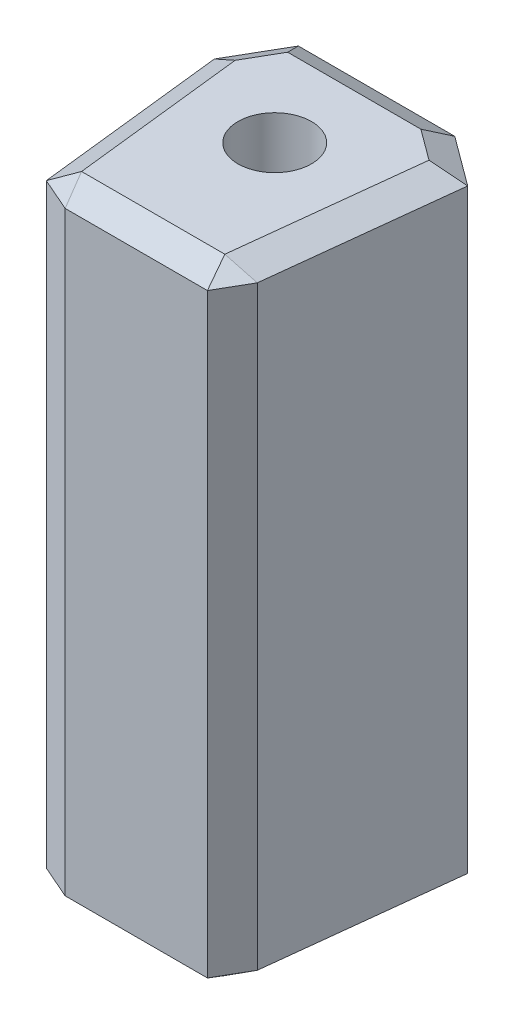
ISO-10303-21;
HEADER;
FILE_DESCRIPTION(('STEP AP214'),'2;1');
FILE_NAME('part.step','',(''),(''),'','','');
FILE_SCHEMA(('AUTOMOTIVE_DESIGN { 1 0 10303 214 1 1 1 1 }'));
ENDSEC;
DATA;
#1=APPLICATION_CONTEXT('core data for automotive mechanical design processes');
#2=APPLICATION_PROTOCOL_DEFINITION('international standard','automotive_design',2000,#1);
#3=PRODUCT_CONTEXT('',#1,'mechanical');
#4=PRODUCT('Part','Part','',(#3));
#5=PRODUCT_RELATED_PRODUCT_CATEGORY('part','',(#4));
#6=PRODUCT_DEFINITION_FORMATION('','',#4);
#7=PRODUCT_DEFINITION_CONTEXT('part definition',#1,'design');
#8=PRODUCT_DEFINITION('design','',#6,#7);
#9=PRODUCT_DEFINITION_SHAPE('','',#8);
#10=(LENGTH_UNIT() NAMED_UNIT(*) SI_UNIT(.MILLI.,.METRE.));
#11=(NAMED_UNIT(*) PLANE_ANGLE_UNIT() SI_UNIT($,.RADIAN.));
#12=(NAMED_UNIT(*) SI_UNIT($,.STERADIAN.) SOLID_ANGLE_UNIT());
#13=UNCERTAINTY_MEASURE_WITH_UNIT(LENGTH_MEASURE(1.E-05),#10,'distance_accuracy_value','');
#14=(GEOMETRIC_REPRESENTATION_CONTEXT(3) GLOBAL_UNCERTAINTY_ASSIGNED_CONTEXT((#13)) GLOBAL_UNIT_ASSIGNED_CONTEXT((#10,
#11,#12)) REPRESENTATION_CONTEXT('',''));
#15=CARTESIAN_POINT('',(0.,0.,0.));
#16=DIRECTION('',(0.,0.,1.));
#17=DIRECTION('',(1.,0.,0.));
#18=AXIS2_PLACEMENT_3D('',#15,#16,#17);
#19=CARTESIAN_POINT('',(0.,-26.9875,61.351983319822));
#20=DIRECTION('',(0.,1.,0.));
#21=DIRECTION('',(0.,0.,1.));
#22=AXIS2_PLACEMENT_3D('',#19,#20,#21);
#23=CYLINDRICAL_SURFACE('',#22,3.175);
#24=CARTESIAN_POINT('',(0.,-26.9875,61.351983319822));
#25=DIRECTION('',(0.,1.,0.));
#26=DIRECTION('',(0.,0.,1.));
#27=AXIS2_PLACEMENT_3D('',#24,#25,#26);
#28=CIRCLE('',#27,3.175);
#29=CARTESIAN_POINT('',(0.,-26.9875,64.526983319822));
#30=VERTEX_POINT('',#29);
#31=EDGE_CURVE('E275',#30,#30,#28,.F.);
#32=ORIENTED_EDGE('',*,*,#31,.T.);
#33=EDGE_LOOP('',(#32));
#34=FACE_BOUND('',#33,.T.);
#35=CARTESIAN_POINT('',(0.,26.9875,61.351983319822));
#36=DIRECTION('',(0.,1.,0.));
#37=DIRECTION('',(0.,0.,1.));
#38=AXIS2_PLACEMENT_3D('',#35,#36,#37);
#39=CIRCLE('',#38,3.175);
#40=CARTESIAN_POINT('',(0.,26.9875,64.526983319822));
#41=VERTEX_POINT('',#40);
#42=EDGE_CURVE('E269',#41,#41,#39,.T.);
#43=ORIENTED_EDGE('',*,*,#42,.T.);
#44=EDGE_LOOP('',(#43));
#45=FACE_BOUND('',#44,.T.);
#46=ADVANCED_FACE('F33',(#34,#45),#23,.F.);
#47=CARTESIAN_POINT('',(0.,26.9875,61.351983319822));
#48=DIRECTION('',(0.,-1.,0.));
#49=DIRECTION('',(0.,0.,-1.));
#50=AXIS2_PLACEMENT_3D('',#47,#48,#49);
#51=PLANE('',#50);
#52=DIRECTION('',(1.,0.,0.));
#53=VECTOR('',#52,1.);
#54=CARTESIAN_POINT('',(8.15555179377801,26.9875,71.8522787942095));
#55=LINE('',#54,#53);
#56=CARTESIAN_POINT('',(-6.18956946928993,26.9875,71.8522787942095));
#57=VERTEX_POINT('',#56);
#58=CARTESIAN_POINT('',(6.18956946928993,26.9875,71.8522787942095));
#59=VERTEX_POINT('',#58);
#60=EDGE_CURVE('E139',#57,#59,#55,.T.);
#61=ORIENTED_EDGE('',*,*,#60,.T.);
#62=DIRECTION('',(0.11186091246358,0.,-0.993723873247904));
#63=VECTOR('',#62,1.);
#64=CARTESIAN_POINT('',(8.11630495456736,26.9875,54.7359956619988));
#65=LINE('',#64,#63);
#66=CARTESIAN_POINT('',(7.97424159573861,26.9875,55.9980249810236));
#67=VERTEX_POINT('',#66);
#68=EDGE_CURVE('E183',#59,#67,#65,.T.);
#69=ORIENTED_EDGE('',*,*,#68,.T.);
#70=DIRECTION('',(-0.804659662347962,0.,-0.59373632850792));
#71=VECTOR('',#70,1.);
#72=CARTESIAN_POINT('',(4.72025423462154,26.9875,53.5969968206666));
#73=LINE('',#72,#71);
#74=CARTESIAN_POINT('',(5.30259191264867,26.9875,54.0266878454345));
#75=VERTEX_POINT('',#74);
#76=EDGE_CURVE('E181',#67,#75,#73,.T.);
#77=ORIENTED_EDGE('',*,*,#76,.T.);
#78=DIRECTION('',(-1.,0.,0.));
#79=VECTOR('',#78,1.);
#80=CARTESIAN_POINT('',(-7.48236225283182,26.9875,54.0266878454345));
#81=LINE('',#80,#79);
#82=CARTESIAN_POINT('',(-6.21236225283181,26.9875,54.0266878454345));
#83=VERTEX_POINT('',#82);
#84=EDGE_CURVE('E179',#75,#83,#81,.T.);
#85=ORIENTED_EDGE('',*,*,#84,.T.);
#86=DIRECTION('',(-0.500000000000002,0.,0.866025403784438));
#87=VECTOR('',#86,1.);
#88=CARTESIAN_POINT('',(-8.23432726075957,26.9875,57.5288339702918));
#89=LINE('',#88,#87);
#90=CARTESIAN_POINT('',(-7.87247385535343,26.9875,56.9020854872365));
#91=VERTEX_POINT('',#90);
#92=EDGE_CURVE('E142',#83,#91,#89,.T.);
#93=ORIENTED_EDGE('',*,*,#92,.T.);
#94=DIRECTION('',(0.11186091246358,0.,0.993723873247904));
#95=VECTOR('',#94,1.);
#96=CARTESIAN_POINT('',(-5.96965289258542,26.9875,73.8059223644367));
#97=LINE('',#96,#95);
#98=EDGE_CURVE('E133',#91,#57,#97,.T.);
#99=ORIENTED_EDGE('',*,*,#98,.T.);
#100=EDGE_LOOP('',(#61,#69,#77,#85,#93,#99));
#101=FACE_BOUND('',#100,.T.);
#102=ORIENTED_EDGE('',*,*,#42,.F.);
#103=EDGE_LOOP('',(#102));
#104=FACE_BOUND('',#103,.T.);
#105=ADVANCED_FACE('F135',(#101,#104),#51,.F.);
#106=CARTESIAN_POINT('',(0.,-26.9875,61.351983319822));
#107=DIRECTION('',(0.,1.,0.));
#108=DIRECTION('',(0.,0.,1.));
#109=AXIS2_PLACEMENT_3D('',#106,#107,#108);
#110=PLANE('',#109);
#111=DIRECTION('',(-0.11186091246358,0.,0.993723873247904));
#112=VECTOR('',#111,1.);
#113=CARTESIAN_POINT('',(5.96965289258544,-26.9875,73.8059223644367));
#114=LINE('',#113,#112);
#115=CARTESIAN_POINT('',(7.97424159573864,-26.9875,55.9980249810236));
#116=VERTEX_POINT('',#115);
#117=CARTESIAN_POINT('',(6.18956946928995,-26.9875,71.8522787942095));
#118=VERTEX_POINT('',#117);
#119=EDGE_CURVE('E42',#116,#118,#114,.T.);
#120=ORIENTED_EDGE('',*,*,#119,.T.);
#121=DIRECTION('',(-1.,0.,0.));
#122=VECTOR('',#121,1.);
#123=CARTESIAN_POINT('',(-8.15555179377802,-26.9875,71.8522787942095));
#124=LINE('',#123,#122);
#125=CARTESIAN_POINT('',(-6.18956946928995,-26.9875,71.8522787942095));
#126=VERTEX_POINT('',#125);
#127=EDGE_CURVE('E11',#118,#126,#124,.T.);
#128=ORIENTED_EDGE('',*,*,#127,.T.);
#129=DIRECTION('',(-0.11186091246358,0.,-0.993723873247904));
#130=VECTOR('',#129,1.);
#131=CARTESIAN_POINT('',(-7.95342835956702,-26.9875,56.1829207521002));
#132=LINE('',#131,#130);
#133=CARTESIAN_POINT('',(-7.87247385535345,-26.9875,56.9020854872365));
#134=VERTEX_POINT('',#133);
#135=EDGE_CURVE('E218',#126,#134,#132,.T.);
#136=ORIENTED_EDGE('',*,*,#135,.T.);
#137=DIRECTION('',(0.500000000000002,0.,-0.866025403784438));
#138=VECTOR('',#137,1.);
#139=CARTESIAN_POINT('',(-5.57736225283182,-26.9875,52.9268355826282));
#140=LINE('',#139,#138);
#141=CARTESIAN_POINT('',(-6.21236225283182,-26.9875,54.0266878454345));
#142=VERTEX_POINT('',#141);
#143=EDGE_CURVE('E220',#134,#142,#140,.T.);
#144=ORIENTED_EDGE('',*,*,#143,.T.);
#145=DIRECTION('',(1.,0.,0.));
#146=VECTOR('',#145,1.);
#147=CARTESIAN_POINT('',(6.02629872346095,-26.9875,54.0266878454345));
#148=LINE('',#147,#146);
#149=CARTESIAN_POINT('',(5.30259191264868,-26.9875,54.0266878454345));
#150=VERTEX_POINT('',#149);
#151=EDGE_CURVE('E222',#142,#150,#148,.T.);
#152=ORIENTED_EDGE('',*,*,#151,.T.);
#153=DIRECTION('',(0.804659662347962,0.,0.59373632850792));
#154=VECTOR('',#153,1.);
#155=CARTESIAN_POINT('',(8.99615936692055,-26.9875,56.7520701182287));
#156=LINE('',#155,#154);
#157=EDGE_CURVE('E53',#150,#116,#156,.T.);
#158=ORIENTED_EDGE('',*,*,#157,.T.);
#159=EDGE_LOOP('',(#120,#128,#136,#144,#152,#158));
#160=FACE_BOUND('',#159,.T.);
#161=ORIENTED_EDGE('',*,*,#31,.F.);
#162=EDGE_LOOP('',(#161));
#163=FACE_BOUND('',#162,.T.);
#164=ADVANCED_FACE('F337',(#160,#163),#110,.F.);
#165=CARTESIAN_POINT('',(-8.15555179377802,57.7814621639103,74.051983319822));
#166=DIRECTION('',(-0.993723873247903,0.,0.11186091246358));
#167=DIRECTION('',(0.11186091246358,0.,0.993723873247903));
#168=AXIS2_PLACEMENT_3D('',#165,#166,#167);
#169=PLANE('',#168);
#170=DIRECTION('',(0.,1.,0.));
#171=VECTOR('',#170,1.);
#172=CARTESIAN_POINT('',(-8.29761515260676,57.7814621639103,72.7899540007972));
#173=LINE('',#172,#171);
#174=CARTESIAN_POINT('',(-8.29761515260676,-25.7175,72.7899540007972));
#175=VERTEX_POINT('',#174);
#176=CARTESIAN_POINT('',(-8.29761515260676,25.7175,72.7899540007972));
#177=VERTEX_POINT('',#176);
#178=EDGE_CURVE('E206',#175,#177,#173,.T.);
#179=ORIENTED_EDGE('',*,*,#178,.T.);
#180=DIRECTION('',(-0.11186091246358,0.,-0.993723873247903));
#181=VECTOR('',#180,1.);
#182=CARTESIAN_POINT('',(-10.1393272607596,25.7175,56.4289817074855));
#183=LINE('',#182,#181);
#184=CARTESIAN_POINT('',(-10.1393272607596,25.7175,56.4289817074855));
#185=VERTEX_POINT('',#184);
#186=EDGE_CURVE('E152',#177,#185,#183,.T.);
#187=ORIENTED_EDGE('',*,*,#186,.T.);
#188=DIRECTION('',(0.,-1.,0.));
#189=VECTOR('',#188,1.);
#190=CARTESIAN_POINT('',(-10.1393272607596,57.7814621639103,56.4289817074855));
#191=LINE('',#190,#189);
#192=CARTESIAN_POINT('',(-10.1393272607596,-25.7175,56.4289817074855));
#193=VERTEX_POINT('',#192);
#194=EDGE_CURVE('E280',#185,#193,#191,.T.);
#195=ORIENTED_EDGE('',*,*,#194,.T.);
#196=DIRECTION('',(0.11186091246358,0.,0.993723873247903));
#197=VECTOR('',#196,1.);
#198=CARTESIAN_POINT('',(-8.15555179377802,-25.7175,74.051983319822));
#199=LINE('',#198,#197);
#200=EDGE_CURVE('E204',#193,#175,#199,.T.);
#201=ORIENTED_EDGE('',*,*,#200,.T.);
#202=EDGE_LOOP('',(#179,#187,#195,#201));
#203=FACE_BOUND('',#202,.T.);
#204=ADVANCED_FACE('F358',(#203),#169,.T.);
#205=CARTESIAN_POINT('',(-10.6573622528318,57.7814621639103,51.826983319822));
#206=DIRECTION('',(0.,0.,-1.));
#207=DIRECTION('',(-1.,0.,0.));
#208=AXIS2_PLACEMENT_3D('',#205,#206,#207);
#209=PLANE('',#208);
#210=DIRECTION('',(0.,1.,0.));
#211=VECTOR('',#210,1.);
#212=CARTESIAN_POINT('',(-7.48236225283182,57.7814621639103,51.826983319822));
#213=LINE('',#212,#211);
#214=CARTESIAN_POINT('',(-7.48236225283182,-25.7175,51.826983319822));
#215=VERTEX_POINT('',#214);
#216=CARTESIAN_POINT('',(-7.48236225283182,25.7175,51.826983319822));
#217=VERTEX_POINT('',#216);
#218=EDGE_CURVE('E174',#215,#217,#213,.T.);
#219=ORIENTED_EDGE('',*,*,#218,.T.);
#220=DIRECTION('',(1.,0.,0.));
#221=VECTOR('',#220,1.);
#222=CARTESIAN_POINT('',(6.02629872346095,25.7175,51.826983319822));
#223=LINE('',#222,#221);
#224=CARTESIAN_POINT('',(6.02629872346095,25.7175,51.826983319822));
#225=VERTEX_POINT('',#224);
#226=EDGE_CURVE('E198',#217,#225,#223,.T.);
#227=ORIENTED_EDGE('',*,*,#226,.T.);
#228=DIRECTION('',(0.,-1.,0.));
#229=VECTOR('',#228,1.);
#230=CARTESIAN_POINT('',(6.02629872346095,57.7814621639103,51.826983319822));
#231=LINE('',#230,#229);
#232=CARTESIAN_POINT('',(6.02629872346095,-25.7175,51.826983319822));
#233=VERTEX_POINT('',#232);
#234=EDGE_CURVE('E285',#225,#233,#231,.T.);
#235=ORIENTED_EDGE('',*,*,#234,.T.);
#236=DIRECTION('',(-1.,0.,0.));
#237=VECTOR('',#236,1.);
#238=CARTESIAN_POINT('',(-7.48236225283182,-25.7175,51.826983319822));
#239=LINE('',#238,#237);
#240=EDGE_CURVE('E196',#233,#215,#239,.T.);
#241=ORIENTED_EDGE('',*,*,#240,.T.);
#242=EDGE_LOOP('',(#219,#227,#235,#241));
#243=FACE_BOUND('',#242,.T.);
#244=ADVANCED_FACE('F291',(#243),#209,.T.);
#245=CARTESIAN_POINT('',(8.15555179377801,57.7814621639103,74.051983319822));
#246=DIRECTION('',(0.993723873247903,0.,0.11186091246358));
#247=DIRECTION('',(0.11186091246358,0.,-0.993723873247903));
#248=AXIS2_PLACEMENT_3D('',#245,#246,#247);
#249=PLANE('',#248);
#250=DIRECTION('',(0.,1.,0.));
#251=VECTOR('',#250,1.);
#252=CARTESIAN_POINT('',(10.30220385576,57.7814621639103,54.9820566173841));
#253=LINE('',#252,#251);
#254=CARTESIAN_POINT('',(10.30220385576,-25.7175,54.9820566173841));
#255=VERTEX_POINT('',#254);
#256=CARTESIAN_POINT('',(10.30220385576,25.7175,54.9820566173841));
#257=VERTEX_POINT('',#256);
#258=EDGE_CURVE('E171',#255,#257,#253,.T.);
#259=ORIENTED_EDGE('',*,*,#258,.T.);
#260=DIRECTION('',(-0.11186091246358,0.,0.993723873247903));
#261=VECTOR('',#260,1.);
#262=CARTESIAN_POINT('',(8.15555179377801,25.7175,74.051983319822));
#263=LINE('',#262,#261);
#264=CARTESIAN_POINT('',(8.46313756566153,25.7175,71.319524609622));
#265=VERTEX_POINT('',#264);
#266=EDGE_CURVE('E189',#257,#265,#263,.T.);
#267=ORIENTED_EDGE('',*,*,#266,.T.);
#268=DIRECTION('',(0.,-1.,0.));
#269=VECTOR('',#268,1.);
#270=CARTESIAN_POINT('',(8.46313756566153,57.7814621639103,71.319524609622));
#271=LINE('',#270,#269);
#272=CARTESIAN_POINT('',(8.46313756566153,-25.7175,71.319524609622));
#273=VERTEX_POINT('',#272);
#274=EDGE_CURVE('E187',#265,#273,#271,.T.);
#275=ORIENTED_EDGE('',*,*,#274,.T.);
#276=DIRECTION('',(0.11186091246358,0.,-0.993723873247903));
#277=VECTOR('',#276,1.);
#278=CARTESIAN_POINT('',(10.30220385576,-25.7175,54.9820566173841));
#279=LINE('',#278,#277);
#280=EDGE_CURVE('E185',#273,#255,#279,.T.);
#281=ORIENTED_EDGE('',*,*,#280,.T.);
#282=EDGE_LOOP('',(#259,#267,#275,#281));
#283=FACE_BOUND('',#282,.T.);
#284=ADVANCED_FACE('F314',(#283),#249,.T.);
#285=CARTESIAN_POINT('',(8.15555179377801,57.7814621639103,74.051983319822));
#286=DIRECTION('',(0.,0.,1.));
#287=DIRECTION('',(1.,0.,0.));
#288=AXIS2_PLACEMENT_3D('',#285,#286,#287);
#289=PLANE('',#288);
#290=DIRECTION('',(0.,1.,0.));
#291=VECTOR('',#290,1.);
#292=CARTESIAN_POINT('',(6.88555179377801,57.7814621639103,74.051983319822));
#293=LINE('',#292,#291);
#294=CARTESIAN_POINT('',(6.88555179377801,-25.7175,74.051983319822));
#295=VERTEX_POINT('',#294);
#296=CARTESIAN_POINT('',(6.88555179377801,25.7175,74.051983319822));
#297=VERTEX_POINT('',#296);
#298=EDGE_CURVE('E213',#295,#297,#293,.T.);
#299=ORIENTED_EDGE('',*,*,#298,.T.);
#300=DIRECTION('',(-1.,0.,0.));
#301=VECTOR('',#300,1.);
#302=CARTESIAN_POINT('',(-8.15555179377802,25.7175,74.051983319822));
#303=LINE('',#302,#301);
#304=CARTESIAN_POINT('',(-5.40583551568441,25.7175,74.051983319822));
#305=VERTEX_POINT('',#304);
#306=EDGE_CURVE('E215',#297,#305,#303,.T.);
#307=ORIENTED_EDGE('',*,*,#306,.T.);
#308=DIRECTION('',(0.,-1.,0.));
#309=VECTOR('',#308,1.);
#310=CARTESIAN_POINT('',(-5.40583551568441,57.7814621639103,74.051983319822));
#311=LINE('',#310,#309);
#312=CARTESIAN_POINT('',(-5.40583551568441,-25.7175,74.051983319822));
#313=VERTEX_POINT('',#312);
#314=EDGE_CURVE('E211',#305,#313,#311,.T.);
#315=ORIENTED_EDGE('',*,*,#314,.T.);
#316=DIRECTION('',(1.,0.,0.));
#317=VECTOR('',#316,1.);
#318=CARTESIAN_POINT('',(8.15555179377801,-25.7175,74.051983319822));
#319=LINE('',#318,#317);
#320=EDGE_CURVE('E209',#313,#295,#319,.T.);
#321=ORIENTED_EDGE('',*,*,#320,.T.);
#322=EDGE_LOOP('',(#299,#307,#315,#321));
#323=FACE_BOUND('',#322,.T.);
#324=ADVANCED_FACE('F376',(#323),#289,.T.);
#325=CARTESIAN_POINT('',(-10.1393272607596,57.7814621639103,56.4289817074855));
#326=DIRECTION('',(0.866025403784438,0.,0.500000000000002));
#327=DIRECTION('',(0.,-1.,0.));
#328=AXIS2_PLACEMENT_3D('',#325,#326,#327);
#329=PLANE('',#328);
#330=ORIENTED_EDGE('',*,*,#194,.F.);
#331=DIRECTION('',(-0.500000000000002,0.,0.866025403784438));
#332=VECTOR('',#331,1.);
#333=CARTESIAN_POINT('',(-7.48236225283182,25.7175,51.826983319822));
#334=LINE('',#333,#332);
#335=EDGE_CURVE('E202',#185,#217,#334,.F.);
#336=ORIENTED_EDGE('',*,*,#335,.T.);
#337=ORIENTED_EDGE('',*,*,#218,.F.);
#338=DIRECTION('',(0.500000000000002,0.,-0.866025403784438));
#339=VECTOR('',#338,1.);
#340=CARTESIAN_POINT('',(-10.1393272607596,-25.7175,56.4289817074855));
#341=LINE('',#340,#339);
#342=EDGE_CURVE('E200',#215,#193,#341,.F.);
#343=ORIENTED_EDGE('',*,*,#342,.T.);
#344=EDGE_LOOP('',(#330,#336,#337,#343));
#345=FACE_BOUND('',#344,.T.);
#346=ADVANCED_FACE('F373',(#345),#329,.F.);
#347=CARTESIAN_POINT('',(6.02629872346095,57.7814621639103,51.826983319822));
#348=DIRECTION('',(-0.59373632850792,0.,0.804659662347962));
#349=DIRECTION('',(0.,-1.,0.));
#350=AXIS2_PLACEMENT_3D('',#347,#348,#349);
#351=PLANE('',#350);
#352=ORIENTED_EDGE('',*,*,#234,.F.);
#353=DIRECTION('',(-0.804659662347962,0.,-0.59373632850792));
#354=VECTOR('',#353,1.);
#355=CARTESIAN_POINT('',(10.30220385576,25.7175,54.9820566173841));
#356=LINE('',#355,#354);
#357=EDGE_CURVE('E194',#225,#257,#356,.F.);
#358=ORIENTED_EDGE('',*,*,#357,.T.);
#359=ORIENTED_EDGE('',*,*,#258,.F.);
#360=DIRECTION('',(0.804659662347962,0.,0.59373632850792));
#361=VECTOR('',#360,1.);
#362=CARTESIAN_POINT('',(6.02629872346095,-25.7175,51.826983319822));
#363=LINE('',#362,#361);
#364=EDGE_CURVE('E192',#255,#233,#363,.F.);
#365=ORIENTED_EDGE('',*,*,#364,.T.);
#366=EDGE_LOOP('',(#352,#358,#359,#365));
#367=FACE_BOUND('',#366,.T.);
#368=ADVANCED_FACE('F310',(#367),#351,.F.);
#369=CARTESIAN_POINT('',(-7.83121767514725,-26.9875,56.8306276869932));
#370=DIRECTION('',(0.433012701892217,0.86602540378444,0.25));
#371=DIRECTION('',(0.500000000000002,0.,-0.866025403784438));
#372=AXIS2_PLACEMENT_3D('',#369,#370,#371);
#373=PLANE('',#372);
#374=DIRECTION('',(-0.858302515958377,0.480862235143889,-0.179132079516602));
#375=VECTOR('',#374,1.);
#376=CARTESIAN_POINT('',(-6.62535400302543,-27.6861963553441,57.1623657129149));
#377=LINE('',#376,#375);
#378=EDGE_CURVE('E262',#193,#134,#377,.F.);
#379=ORIENTED_EDGE('',*,*,#378,.F.);
#380=ORIENTED_EDGE('',*,*,#342,.F.);
#381=DIRECTION('',(-0.447213595499958,0.447213595499956,-0.774596669241484));
#382=VECTOR('',#381,1.);
#383=CARTESIAN_POINT('',(-5.56482008390565,-27.6350421689262,55.1482637820579));
#384=LINE('',#383,#382);
#385=EDGE_CURVE('E37',#142,#215,#384,.T.);
#386=ORIENTED_EDGE('',*,*,#385,.F.);
#387=ORIENTED_EDGE('',*,*,#143,.F.);
#388=EDGE_LOOP('',(#379,#380,#386,#387));
#389=FACE_BOUND('',#388,.T.);
#390=ADVANCED_FACE('F35',(#389),#373,.F.);
#391=CARTESIAN_POINT('',(0.,-26.9875,54.0266878454345));
#392=DIRECTION('',(0.,-0.86602540378444,-0.499999999999998));
#393=DIRECTION('',(-1.,0.,0.));
#394=AXIS2_PLACEMENT_3D('',#391,#392,#393);
#395=PLANE('',#394);
#396=ORIENTED_EDGE('',*,*,#385,.T.);
#397=ORIENTED_EDGE('',*,*,#240,.F.);
#398=DIRECTION('',(0.274018326485077,0.48086223514389,-0.832877822710354));
#399=VECTOR('',#398,1.);
#400=CARTESIAN_POINT('',(4.90444126696012,-27.6861963677417,55.2368654534269));
#401=LINE('',#400,#399);
#402=EDGE_CURVE('E260',#150,#233,#401,.T.);
#403=ORIENTED_EDGE('',*,*,#402,.F.);
#404=ORIENTED_EDGE('',*,*,#151,.F.);
#405=EDGE_LOOP('',(#396,#397,#403,#404));
#406=FACE_BOUND('',#405,.T.);
#407=ADVANCED_FACE('F343',(#406),#395,.T.);
#408=CARTESIAN_POINT('',(-7.27932109610744,-26.9875,62.1713975674284));
#409=DIRECTION('',(-0.49686193662395,-0.86602540378444,0.0559304562317897));
#410=DIRECTION('',(0.11186091246358,0.,0.993723873247903));
#411=AXIS2_PLACEMENT_3D('',#408,#409,#410);
#412=PLANE('',#411);
#413=ORIENTED_EDGE('',*,*,#378,.T.);
#414=ORIENTED_EDGE('',*,*,#135,.F.);
#415=DIRECTION('',(0.8004344008291,-0.482224696123996,-0.3560394815431));
#416=VECTOR('',#415,1.);
#417=CARTESIAN_POINT('',(-6.80452673478932,-26.6170166972115,72.1258165953744));
#418=LINE('',#417,#416);
#419=EDGE_CURVE('E257',#175,#126,#418,.T.);
#420=ORIENTED_EDGE('',*,*,#419,.F.);
#421=ORIENTED_EDGE('',*,*,#200,.F.);
#422=EDGE_LOOP('',(#413,#414,#420,#421));
#423=FACE_BOUND('',#422,.T.);
#424=ADVANCED_FACE('F348',(#423),#412,.T.);
#425=CARTESIAN_POINT('',(5.36898616950178,-26.9875,54.0756783492991));
#426=DIRECTION('',(-0.296868164253959,0.866025403784439,0.40232983117398));
#427=DIRECTION('',(0.804659662347962,0.,0.59373632850792));
#428=AXIS2_PLACEMENT_3D('',#425,#426,#427);
#429=PLANE('',#428);
#430=ORIENTED_EDGE('',*,*,#402,.T.);
#431=ORIENTED_EDGE('',*,*,#364,.F.);
#432=DIRECTION('',(0.819760923222317,0.447213595499956,-0.357759736076736));
#433=VECTOR('',#432,1.);
#434=CARTESIAN_POINT('',(6.7872701033101,-27.6350421965691,56.5160426076661));
#435=LINE('',#434,#433);
#436=EDGE_CURVE('E254',#116,#255,#435,.T.);
#437=ORIENTED_EDGE('',*,*,#436,.F.);
#438=ORIENTED_EDGE('',*,*,#157,.F.);
#439=EDGE_LOOP('',(#430,#431,#437,#438));
#440=FACE_BOUND('',#439,.T.);
#441=ADVANCED_FACE('F345',(#440),#429,.F.);
#442=CARTESIAN_POINT('',(-5.40583551568441,-25.7175,74.051983319822));
#443=DIRECTION('',(-0.239154945433982,-0.801566240282257,0.547993133637855));
#444=DIRECTION('',(0.,-0.564370361850618,-0.82552171059555));
#445=AXIS2_PLACEMENT_3D('',#442,#443,#444);
#446=PLANE('',#445);
#447=DIRECTION('',(0.916520574811541,0.,0.399987544739985));
#448=VECTOR('',#447,1.);
#449=CARTESIAN_POINT('',(-5.40583551568441,-25.7175,74.051983319822));
#450=LINE('',#449,#448);
#451=EDGE_CURVE('E249',#175,#313,#450,.T.);
#452=ORIENTED_EDGE('',*,*,#451,.F.);
#453=ORIENTED_EDGE('',*,*,#419,.T.);
#454=DIRECTION('',(0.294840267172246,0.477773276998041,0.827527590259293));
#455=VECTOR('',#454,1.);
#456=CARTESIAN_POINT('',(-5.40583551568441,-25.7175,74.051983319822));
#457=LINE('',#456,#455);
#458=EDGE_CURVE('E252',#313,#126,#457,.F.);
#459=ORIENTED_EDGE('',*,*,#458,.F.);
#460=EDGE_LOOP('',(#452,#453,#459));
#461=FACE_BOUND('',#460,.T.);
#462=ADVANCED_FACE('F347',(#461),#446,.T.);
#463=CARTESIAN_POINT('',(7.27932109610743,-26.9875,62.1713975674284));
#464=DIRECTION('',(0.496861936623949,-0.86602540378444,0.0559304562317897));
#465=DIRECTION('',(0.11186091246358,0.,-0.993723873247903));
#466=AXIS2_PLACEMENT_3D('',#463,#464,#465);
#467=PLANE('',#466);
#468=ORIENTED_EDGE('',*,*,#436,.T.);
#469=ORIENTED_EDGE('',*,*,#280,.F.);
#470=DIRECTION('',(0.855315023528859,0.47777327699804,-0.200421820948673));
#471=VECTOR('',#470,1.);
#472=CARTESIAN_POINT('',(8.46313756566153,-25.7175,71.319524609622));
#473=LINE('',#472,#471);
#474=EDGE_CURVE('E246',#118,#273,#473,.T.);
#475=ORIENTED_EDGE('',*,*,#474,.F.);
#476=ORIENTED_EDGE('',*,*,#119,.F.);
#477=EDGE_LOOP('',(#468,#469,#475,#476));
#478=FACE_BOUND('',#477,.T.);
#479=ADVANCED_FACE('F329',(#478),#467,.T.);
#480=CARTESIAN_POINT('',(0.,-26.9875,71.8522787942095));
#481=DIRECTION('',(0.,-0.86602540378444,0.499999999999997));
#482=DIRECTION('',(1.,0.,0.));
#483=AXIS2_PLACEMENT_3D('',#480,#481,#482);
#484=PLANE('',#483);
#485=ORIENTED_EDGE('',*,*,#458,.T.);
#486=ORIENTED_EDGE('',*,*,#127,.F.);
#487=DIRECTION('',(-0.264267610184196,-0.482224696123996,-0.835237674351231));
#488=VECTOR('',#487,1.);
#489=CARTESIAN_POINT('',(6.39260083169839,-26.6170166972115,72.493974697995));
#490=LINE('',#489,#488);
#491=EDGE_CURVE('E243',#295,#118,#490,.T.);
#492=ORIENTED_EDGE('',*,*,#491,.F.);
#493=ORIENTED_EDGE('',*,*,#320,.F.);
#494=EDGE_LOOP('',(#485,#486,#492,#493));
#495=FACE_BOUND('',#494,.T.);
#496=ADVANCED_FACE('F335',(#495),#484,.T.);
#497=CARTESIAN_POINT('',(-5.40583551568441,57.7814621639103,74.051983319822));
#498=DIRECTION('',(0.399987544739985,0.,-0.916520574811541));
#499=DIRECTION('',(0.,-1.,0.));
#500=AXIS2_PLACEMENT_3D('',#497,#498,#499);
#501=PLANE('',#500);
#502=ORIENTED_EDGE('',*,*,#451,.T.);
#503=ORIENTED_EDGE('',*,*,#314,.F.);
#504=DIRECTION('',(-0.916520574811541,0.,-0.399987544739985));
#505=VECTOR('',#504,1.);
#506=CARTESIAN_POINT('',(-6.87058451764001,25.7175,73.4127381429496));
#507=LINE('',#506,#505);
#508=EDGE_CURVE('E156',#177,#305,#507,.F.);
#509=ORIENTED_EDGE('',*,*,#508,.F.);
#510=ORIENTED_EDGE('',*,*,#178,.F.);
#511=EDGE_LOOP('',(#502,#503,#509,#510));
#512=FACE_BOUND('',#511,.T.);
#513=ADVANCED_FACE('F399',(#512),#501,.F.);
#514=CARTESIAN_POINT('',(-7.27932109610742,26.9875,62.1713975674284));
#515=DIRECTION('',(-0.49686193662395,0.866025403784439,0.0559304562317898));
#516=DIRECTION('',(-0.11186091246358,0.,-0.993723873247903));
#517=AXIS2_PLACEMENT_3D('',#514,#515,#516);
#518=PLANE('',#517);
#519=DIRECTION('',(0.858302515958377,0.48086223514389,0.179132079516603));
#520=VECTOR('',#519,1.);
#521=CARTESIAN_POINT('',(-6.62535400302541,27.6861963553441,57.1623657129149));
#522=LINE('',#521,#520);
#523=EDGE_CURVE('E157',#185,#91,#522,.T.);
#524=ORIENTED_EDGE('',*,*,#523,.F.);
#525=ORIENTED_EDGE('',*,*,#186,.F.);
#526=DIRECTION('',(-0.800434400829099,-0.482224696123997,0.356039481543101));
#527=VECTOR('',#526,1.);
#528=CARTESIAN_POINT('',(-6.18956946928993,26.9875,71.8522787942095));
#529=LINE('',#528,#527);
#530=EDGE_CURVE('E149',#57,#177,#529,.T.);
#531=ORIENTED_EDGE('',*,*,#530,.F.);
#532=ORIENTED_EDGE('',*,*,#98,.F.);
#533=EDGE_LOOP('',(#524,#525,#531,#532));
#534=FACE_BOUND('',#533,.T.);
#535=ADVANCED_FACE('F151',(#534),#518,.T.);
#536=CARTESIAN_POINT('',(8.46313756566153,-25.7175,71.319524609622));
#537=DIRECTION('',(0.517801768855446,-0.801566240282255,0.298952990635555));
#538=DIRECTION('',(0.839980356827693,0.542616807833688,0.));
#539=AXIS2_PLACEMENT_3D('',#536,#537,#538);
#540=PLANE('',#539);
#541=ORIENTED_EDGE('',*,*,#491,.T.);
#542=ORIENTED_EDGE('',*,*,#474,.T.);
#543=DIRECTION('',(0.499999999999999,0.,-0.866025403784439));
#544=VECTOR('',#543,1.);
#545=CARTESIAN_POINT('',(8.46313756566153,-25.7175,71.319524609622));
#546=LINE('',#545,#544);
#547=EDGE_CURVE('E164',#295,#273,#546,.T.);
#548=ORIENTED_EDGE('',*,*,#547,.F.);
#549=EDGE_LOOP('',(#541,#542,#548));
#550=FACE_BOUND('',#549,.T.);
#551=ADVANCED_FACE('F331',(#550),#540,.T.);
#552=CARTESIAN_POINT('',(-6.18956946928993,26.9875,71.8522787942095));
#553=DIRECTION('',(-0.239154945433982,0.801566240282258,0.547993133637854));
#554=DIRECTION('',(0.,-0.564370361850618,0.82552171059555));
#555=AXIS2_PLACEMENT_3D('',#552,#553,#554);
#556=PLANE('',#555);
#557=ORIENTED_EDGE('',*,*,#530,.T.);
#558=ORIENTED_EDGE('',*,*,#508,.T.);
#559=DIRECTION('',(-0.294840267172236,0.477773276998044,-0.827527590259294));
#560=VECTOR('',#559,1.);
#561=CARTESIAN_POINT('',(-6.18956946928993,26.9875,71.8522787942095));
#562=LINE('',#561,#560);
#563=EDGE_CURVE('E159',#57,#305,#562,.F.);
#564=ORIENTED_EDGE('',*,*,#563,.F.);
#565=EDGE_LOOP('',(#557,#558,#564));
#566=FACE_BOUND('',#565,.T.);
#567=ADVANCED_FACE('F160',(#566),#556,.T.);
#568=CARTESIAN_POINT('',(-7.83121767514723,26.9875,56.8306276869932));
#569=DIRECTION('',(0.433012701892217,-0.86602540378444,0.25));
#570=DIRECTION('',(-0.500000000000002,0.,0.866025403784438));
#571=AXIS2_PLACEMENT_3D('',#568,#569,#570);
#572=PLANE('',#571);
#573=ORIENTED_EDGE('',*,*,#523,.T.);
#574=ORIENTED_EDGE('',*,*,#92,.F.);
#575=DIRECTION('',(0.447213595499958,0.447213595499957,0.774596669241484));
#576=VECTOR('',#575,1.);
#577=CARTESIAN_POINT('',(-5.56482008390564,27.6350421689262,55.148263782058));
#578=LINE('',#577,#576);
#579=EDGE_CURVE('E165',#217,#83,#578,.T.);
#580=ORIENTED_EDGE('',*,*,#579,.F.);
#581=ORIENTED_EDGE('',*,*,#335,.F.);
#582=EDGE_LOOP('',(#573,#574,#580,#581));
#583=FACE_BOUND('',#582,.T.);
#584=ADVANCED_FACE('F298',(#583),#572,.F.);
#585=CARTESIAN_POINT('',(8.46313756566153,57.7814621639103,71.319524609622));
#586=DIRECTION('',(-0.866025403784439,0.,-0.499999999999999));
#587=DIRECTION('',(0.,-1.,0.));
#588=AXIS2_PLACEMENT_3D('',#585,#586,#587);
#589=PLANE('',#588);
#590=ORIENTED_EDGE('',*,*,#547,.T.);
#591=ORIENTED_EDGE('',*,*,#274,.F.);
#592=DIRECTION('',(-0.499999999999999,0.,0.866025403784439));
#593=VECTOR('',#592,1.);
#594=CARTESIAN_POINT('',(8.46313756566153,25.7175,71.319524609622));
#595=LINE('',#594,#593);
#596=EDGE_CURVE('E234',#297,#265,#595,.F.);
#597=ORIENTED_EDGE('',*,*,#596,.F.);
#598=ORIENTED_EDGE('',*,*,#298,.F.);
#599=EDGE_LOOP('',(#590,#591,#597,#598));
#600=FACE_BOUND('',#599,.T.);
#601=ADVANCED_FACE('F325',(#600),#589,.F.);
#602=CARTESIAN_POINT('',(0.,26.9875,71.8522787942095));
#603=DIRECTION('',(0.,0.866025403784439,0.499999999999999));
#604=DIRECTION('',(-1.,0.,0.));
#605=AXIS2_PLACEMENT_3D('',#602,#603,#604);
#606=PLANE('',#605);
#607=ORIENTED_EDGE('',*,*,#563,.T.);
#608=ORIENTED_EDGE('',*,*,#306,.F.);
#609=DIRECTION('',(0.2642676101842,-0.482224696123997,0.835237674351229));
#610=VECTOR('',#609,1.);
#611=CARTESIAN_POINT('',(6.39260083169838,26.6170166972115,72.4939746979951));
#612=LINE('',#611,#610);
#613=EDGE_CURVE('E169',#59,#297,#612,.T.);
#614=ORIENTED_EDGE('',*,*,#613,.F.);
#615=ORIENTED_EDGE('',*,*,#60,.F.);
#616=EDGE_LOOP('',(#607,#608,#614,#615));
#617=FACE_BOUND('',#616,.T.);
#618=ADVANCED_FACE('F167',(#617),#606,.T.);
#619=CARTESIAN_POINT('',(0.,26.9875,54.0266878454345));
#620=DIRECTION('',(0.,0.866025403784439,-0.499999999999999));
#621=DIRECTION('',(1.,0.,0.));
#622=AXIS2_PLACEMENT_3D('',#619,#620,#621);
#623=PLANE('',#622);
#624=ORIENTED_EDGE('',*,*,#579,.T.);
#625=ORIENTED_EDGE('',*,*,#84,.F.);
#626=DIRECTION('',(-0.274018326485076,0.480862235143891,0.832877822710354));
#627=VECTOR('',#626,1.);
#628=CARTESIAN_POINT('',(4.90444126696012,27.6861963677417,55.2368654534269));
#629=LINE('',#628,#627);
#630=EDGE_CURVE('E230',#225,#75,#629,.T.);
#631=ORIENTED_EDGE('',*,*,#630,.F.);
#632=ORIENTED_EDGE('',*,*,#226,.F.);
#633=EDGE_LOOP('',(#624,#625,#631,#632));
#634=FACE_BOUND('',#633,.T.);
#635=ADVANCED_FACE('F302',(#634),#623,.T.);
#636=CARTESIAN_POINT('',(8.46313756566153,25.7175,71.319524609622));
#637=DIRECTION('',(0.517801768855445,0.801566240282255,0.298952990635555));
#638=DIRECTION('',(-0.839980356827694,0.542616807833687,0.));
#639=AXIS2_PLACEMENT_3D('',#636,#637,#638);
#640=PLANE('',#639);
#641=ORIENTED_EDGE('',*,*,#613,.T.);
#642=ORIENTED_EDGE('',*,*,#596,.T.);
#643=DIRECTION('',(-0.85531502352886,0.477773276998041,0.200421820948666));
#644=VECTOR('',#643,1.);
#645=CARTESIAN_POINT('',(8.46313756566153,25.7175,71.319524609622));
#646=LINE('',#645,#644);
#647=EDGE_CURVE('E228',#59,#265,#646,.F.);
#648=ORIENTED_EDGE('',*,*,#647,.F.);
#649=EDGE_LOOP('',(#641,#642,#648));
#650=FACE_BOUND('',#649,.T.);
#651=ADVANCED_FACE('F322',(#650),#640,.T.);
#652=CARTESIAN_POINT('',(5.36898616950177,26.9875,54.0756783492991));
#653=DIRECTION('',(-0.296868164253959,-0.866025403784439,0.40232983117398));
#654=DIRECTION('',(-0.804659662347962,0.,-0.59373632850792));
#655=AXIS2_PLACEMENT_3D('',#652,#653,#654);
#656=PLANE('',#655);
#657=ORIENTED_EDGE('',*,*,#630,.T.);
#658=ORIENTED_EDGE('',*,*,#76,.F.);
#659=DIRECTION('',(-0.819760923222317,0.447213595499957,0.357759736076735));
#660=VECTOR('',#659,1.);
#661=CARTESIAN_POINT('',(6.78727010331008,27.6350421965691,56.5160426076661));
#662=LINE('',#661,#660);
#663=EDGE_CURVE('E226',#257,#67,#662,.T.);
#664=ORIENTED_EDGE('',*,*,#663,.F.);
#665=ORIENTED_EDGE('',*,*,#357,.F.);
#666=EDGE_LOOP('',(#657,#658,#664,#665));
#667=FACE_BOUND('',#666,.T.);
#668=ADVANCED_FACE('F307',(#667),#656,.F.);
#669=CARTESIAN_POINT('',(7.27932109610741,26.9875,62.1713975674284));
#670=DIRECTION('',(0.49686193662395,0.866025403784439,0.0559304562317898));
#671=DIRECTION('',(-0.11186091246358,0.,0.993723873247903));
#672=AXIS2_PLACEMENT_3D('',#669,#670,#671);
#673=PLANE('',#672);
#674=ORIENTED_EDGE('',*,*,#647,.T.);
#675=ORIENTED_EDGE('',*,*,#266,.F.);
#676=ORIENTED_EDGE('',*,*,#663,.T.);
#677=ORIENTED_EDGE('',*,*,#68,.F.);
#678=EDGE_LOOP('',(#674,#675,#676,#677));
#679=FACE_BOUND('',#678,.T.);
#680=ADVANCED_FACE('F317',(#679),#673,.T.);
#681=CLOSED_SHELL('',(#46,#105,#164,#204,#244,#284,#324,#346,#368,#390,#407,#424,#441,#462,#479,
#496,#513,#535,#551,#567,#584,#601,#618,#635,#651,#668,#680));
#682=MANIFOLD_SOLID_BREP('B2',#681);
#683=ADVANCED_BREP_SHAPE_REPRESENTATION('',(#18,#682),#14);
#684=SHAPE_DEFINITION_REPRESENTATION(#9,#683);
ENDSEC;
END-ISO-10303-21;
